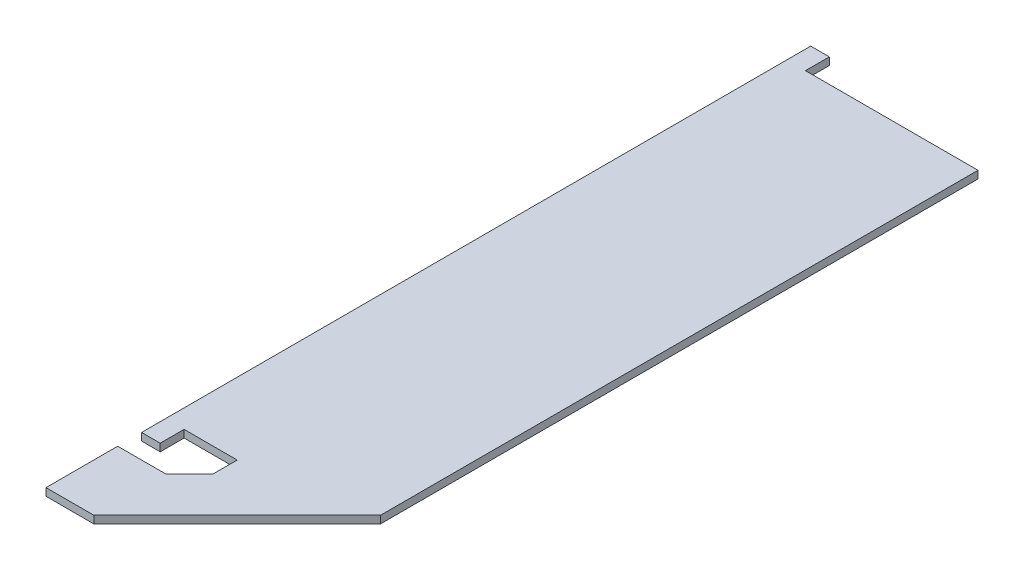
ISO-10303-21;
HEADER;
FILE_DESCRIPTION(('STEP AP214'),'2;1');
FILE_NAME('part.step','',(''),(''),'','','');
FILE_SCHEMA(('AUTOMOTIVE_DESIGN { 1 0 10303 214 1 1 1 1 }'));
ENDSEC;
DATA;
#1=APPLICATION_CONTEXT('core data for automotive mechanical design processes');
#2=APPLICATION_PROTOCOL_DEFINITION('international standard','automotive_design',2000,#1);
#3=PRODUCT_CONTEXT('',#1,'mechanical');
#4=PRODUCT('Part','Part','',(#3));
#5=PRODUCT_RELATED_PRODUCT_CATEGORY('part','',(#4));
#6=PRODUCT_DEFINITION_FORMATION('','',#4);
#7=PRODUCT_DEFINITION_CONTEXT('part definition',#1,'design');
#8=PRODUCT_DEFINITION('design','',#6,#7);
#9=PRODUCT_DEFINITION_SHAPE('','',#8);
#10=(LENGTH_UNIT() NAMED_UNIT(*) SI_UNIT(.MILLI.,.METRE.));
#11=(NAMED_UNIT(*) PLANE_ANGLE_UNIT() SI_UNIT($,.RADIAN.));
#12=(NAMED_UNIT(*) SI_UNIT($,.STERADIAN.) SOLID_ANGLE_UNIT());
#13=UNCERTAINTY_MEASURE_WITH_UNIT(LENGTH_MEASURE(1.E-05),#10,'distance_accuracy_value','');
#14=(GEOMETRIC_REPRESENTATION_CONTEXT(3) GLOBAL_UNCERTAINTY_ASSIGNED_CONTEXT((#13)) GLOBAL_UNIT_ASSIGNED_CONTEXT((#10,
#11,#12)) REPRESENTATION_CONTEXT('',''));
#15=CARTESIAN_POINT('',(0.,0.,0.));
#16=DIRECTION('',(0.,0.,1.));
#17=DIRECTION('',(1.,0.,0.));
#18=AXIS2_PLACEMENT_3D('',#15,#16,#17);
#19=CARTESIAN_POINT('',(-12.7,1.00076,41.275));
#20=DIRECTION('',(0.,0.,-1.));
#21=DIRECTION('',(-1.,0.,0.));
#22=AXIS2_PLACEMENT_3D('',#19,#20,#21);
#23=PLANE('',#22);
#24=DIRECTION('',(0.,1.,0.));
#25=VECTOR('',#24,1.);
#26=CARTESIAN_POINT('',(-10.2278817944119,0.,41.275));
#27=LINE('',#26,#25);
#28=CARTESIAN_POINT('',(-10.2278817944119,0.,41.275));
#29=VERTEX_POINT('',#28);
#30=CARTESIAN_POINT('',(-10.2278817944119,1.00076,41.275));
#31=VERTEX_POINT('',#30);
#32=EDGE_CURVE('E239',#29,#31,#27,.T.);
#33=ORIENTED_EDGE('',*,*,#32,.F.);
#34=DIRECTION('',(1.,0.,0.));
#35=VECTOR('',#34,1.);
#36=CARTESIAN_POINT('',(-12.7,0.,41.275));
#37=LINE('',#36,#35);
#38=CARTESIAN_POINT('',(-3.175,0.,41.275));
#39=VERTEX_POINT('',#38);
#40=EDGE_CURVE('E269',#29,#39,#37,.T.);
#41=ORIENTED_EDGE('',*,*,#40,.T.);
#42=DIRECTION('',(0.,-1.,0.));
#43=VECTOR('',#42,1.);
#44=CARTESIAN_POINT('',(-3.175,1.00076,41.275));
#45=LINE('',#44,#43);
#46=CARTESIAN_POINT('',(-3.175,1.00076,41.275));
#47=VERTEX_POINT('',#46);
#48=EDGE_CURVE('E297',#47,#39,#45,.T.);
#49=ORIENTED_EDGE('',*,*,#48,.F.);
#50=DIRECTION('',(1.,0.,0.));
#51=VECTOR('',#50,1.);
#52=CARTESIAN_POINT('',(-12.7,1.00076,41.275));
#53=LINE('',#52,#51);
#54=EDGE_CURVE('E162',#31,#47,#53,.T.);
#55=ORIENTED_EDGE('',*,*,#54,.F.);
#56=EDGE_LOOP('',(#33,#41,#49,#55));
#57=FACE_BOUND('',#56,.T.);
#58=ADVANCED_FACE('F47',(#57),#23,.F.);
#59=CARTESIAN_POINT('',(-12.7,1.00076,-41.275));
#60=DIRECTION('',(0.,0.,1.));
#61=DIRECTION('',(1.,0.,0.));
#62=AXIS2_PLACEMENT_3D('',#59,#60,#61);
#63=PLANE('',#62);
#64=DIRECTION('',(-1.,0.,0.));
#65=VECTOR('',#64,1.);
#66=CARTESIAN_POINT('',(-12.7,0.,-41.275));
#67=LINE('',#66,#65);
#68=CARTESIAN_POINT('',(12.7,0.,-41.275));
#69=VERTEX_POINT('',#68);
#70=CARTESIAN_POINT('',(-10.2278817944119,0.,-41.275));
#71=VERTEX_POINT('',#70);
#72=EDGE_CURVE('E221',#69,#71,#67,.T.);
#73=ORIENTED_EDGE('',*,*,#72,.T.);
#74=DIRECTION('',(0.,1.,0.));
#75=VECTOR('',#74,1.);
#76=CARTESIAN_POINT('',(-10.2278817944119,0.,-41.275));
#77=LINE('',#76,#75);
#78=CARTESIAN_POINT('',(-10.2278817944119,1.00076,-41.275));
#79=VERTEX_POINT('',#78);
#80=EDGE_CURVE('E174',#71,#79,#77,.T.);
#81=ORIENTED_EDGE('',*,*,#80,.T.);
#82=DIRECTION('',(-1.,0.,0.));
#83=VECTOR('',#82,1.);
#84=CARTESIAN_POINT('',(-12.7,1.00076,-41.275));
#85=LINE('',#84,#83);
#86=CARTESIAN_POINT('',(12.7,1.00076,-41.275));
#87=VERTEX_POINT('',#86);
#88=EDGE_CURVE('E163',#87,#79,#85,.T.);
#89=ORIENTED_EDGE('',*,*,#88,.F.);
#90=DIRECTION('',(0.,-1.,0.));
#91=VECTOR('',#90,1.);
#92=CARTESIAN_POINT('',(12.7,1.00076,-41.275));
#93=LINE('',#92,#91);
#94=EDGE_CURVE('E301',#87,#69,#93,.T.);
#95=ORIENTED_EDGE('',*,*,#94,.T.);
#96=EDGE_LOOP('',(#73,#81,#89,#95));
#97=FACE_BOUND('',#96,.T.);
#98=ADVANCED_FACE('F330',(#97),#63,.F.);
#99=CARTESIAN_POINT('',(-12.7,1.00076,41.275));
#100=DIRECTION('',(1.,0.,0.));
#101=DIRECTION('',(0.,0.,-1.));
#102=AXIS2_PLACEMENT_3D('',#99,#100,#101);
#103=PLANE('',#102);
#104=DIRECTION('',(0.,0.,1.));
#105=VECTOR('',#104,1.);
#106=CARTESIAN_POINT('',(-12.7,0.,41.275));
#107=LINE('',#106,#105);
#108=CARTESIAN_POINT('',(-12.7,0.,-44.45));
#109=VERTEX_POINT('',#108);
#110=CARTESIAN_POINT('',(-12.7,0.,44.45));
#111=VERTEX_POINT('',#110);
#112=EDGE_CURVE('E266',#109,#111,#107,.T.);
#113=ORIENTED_EDGE('',*,*,#112,.T.);
#114=DIRECTION('',(0.,-1.,0.));
#115=VECTOR('',#114,1.);
#116=CARTESIAN_POINT('',(-12.7,0.,44.45));
#117=LINE('',#116,#115);
#118=CARTESIAN_POINT('',(-12.7,1.00076,44.45));
#119=VERTEX_POINT('',#118);
#120=EDGE_CURVE('E156',#119,#111,#117,.T.);
#121=ORIENTED_EDGE('',*,*,#120,.F.);
#122=DIRECTION('',(0.,0.,1.));
#123=VECTOR('',#122,1.);
#124=CARTESIAN_POINT('',(-12.7,1.00076,41.275));
#125=LINE('',#124,#123);
#126=CARTESIAN_POINT('',(-12.7,1.00076,-44.45));
#127=VERTEX_POINT('',#126);
#128=EDGE_CURVE('E150',#127,#119,#125,.T.);
#129=ORIENTED_EDGE('',*,*,#128,.F.);
#130=DIRECTION('',(0.,-1.,0.));
#131=VECTOR('',#130,1.);
#132=CARTESIAN_POINT('',(-12.7,0.,-44.45));
#133=LINE('',#132,#131);
#134=EDGE_CURVE('E153',#127,#109,#133,.T.);
#135=ORIENTED_EDGE('',*,*,#134,.T.);
#136=EDGE_LOOP('',(#113,#121,#129,#135));
#137=FACE_BOUND('',#136,.T.);
#138=ADVANCED_FACE('F152',(#137),#103,.F.);
#139=CARTESIAN_POINT('',(-3.175,1.00076,41.275));
#140=DIRECTION('',(1.,0.,0.));
#141=DIRECTION('',(0.,0.,-1.));
#142=AXIS2_PLACEMENT_3D('',#139,#140,#141);
#143=PLANE('',#142);
#144=DIRECTION('',(0.,0.,1.));
#145=VECTOR('',#144,1.);
#146=CARTESIAN_POINT('',(-3.175,0.,41.275));
#147=LINE('',#146,#145);
#148=CARTESIAN_POINT('',(-3.175,0.,44.45));
#149=VERTEX_POINT('',#148);
#150=EDGE_CURVE('E272',#39,#149,#147,.T.);
#151=ORIENTED_EDGE('',*,*,#150,.T.);
#152=DIRECTION('',(0.,1.,0.));
#153=VECTOR('',#152,1.);
#154=CARTESIAN_POINT('',(-3.175,1.00076,44.45));
#155=LINE('',#154,#153);
#156=CARTESIAN_POINT('',(-3.175,1.00076,44.45));
#157=VERTEX_POINT('',#156);
#158=EDGE_CURVE('E64',#149,#157,#155,.T.);
#159=ORIENTED_EDGE('',*,*,#158,.T.);
#160=DIRECTION('',(0.,0.,1.));
#161=VECTOR('',#160,1.);
#162=CARTESIAN_POINT('',(-3.175,1.00076,41.275));
#163=LINE('',#162,#161);
#164=EDGE_CURVE('E203',#47,#157,#163,.T.);
#165=ORIENTED_EDGE('',*,*,#164,.F.);
#166=ORIENTED_EDGE('',*,*,#48,.T.);
#167=EDGE_LOOP('',(#151,#159,#165,#166));
#168=FACE_BOUND('',#167,.T.);
#169=ADVANCED_FACE('F355',(#168),#143,.F.);
#170=CARTESIAN_POINT('',(-3.175,1.00076,47.625));
#171=DIRECTION('',(0.,0.,1.));
#172=DIRECTION('',(1.,0.,0.));
#173=AXIS2_PLACEMENT_3D('',#170,#171,#172);
#174=PLANE('',#173);
#175=DIRECTION('',(-1.,0.,0.));
#176=VECTOR('',#175,1.);
#177=CARTESIAN_POINT('',(-3.175,1.00076,47.625));
#178=LINE('',#177,#176);
#179=CARTESIAN_POINT('',(-6.35000000000004,1.00076,47.625));
#180=VERTEX_POINT('',#179);
#181=CARTESIAN_POINT('',(-12.7,1.00076,47.625));
#182=VERTEX_POINT('',#181);
#183=EDGE_CURVE('E209',#180,#182,#178,.T.);
#184=ORIENTED_EDGE('',*,*,#183,.F.);
#185=DIRECTION('',(0.,-1.,0.));
#186=VECTOR('',#185,1.);
#187=CARTESIAN_POINT('',(-6.35000000000004,0.,47.625));
#188=LINE('',#187,#186);
#189=CARTESIAN_POINT('',(-6.35000000000004,0.,47.625));
#190=VERTEX_POINT('',#189);
#191=EDGE_CURVE('E318',#180,#190,#188,.T.);
#192=ORIENTED_EDGE('',*,*,#191,.T.);
#193=DIRECTION('',(-1.,0.,0.));
#194=VECTOR('',#193,1.);
#195=CARTESIAN_POINT('',(-3.175,0.,47.625));
#196=LINE('',#195,#194);
#197=CARTESIAN_POINT('',(-12.7,0.,47.625));
#198=VERTEX_POINT('',#197);
#199=EDGE_CURVE('E278',#190,#198,#196,.T.);
#200=ORIENTED_EDGE('',*,*,#199,.T.);
#201=DIRECTION('',(0.,-1.,0.));
#202=VECTOR('',#201,1.);
#203=CARTESIAN_POINT('',(-12.7,1.00076,47.625));
#204=LINE('',#203,#202);
#205=EDGE_CURVE('E293',#182,#198,#204,.T.);
#206=ORIENTED_EDGE('',*,*,#205,.F.);
#207=EDGE_LOOP('',(#184,#192,#200,#206));
#208=FACE_BOUND('',#207,.T.);
#209=ADVANCED_FACE('F350',(#208),#174,.F.);
#210=CARTESIAN_POINT('',(-12.7,1.00076,47.625));
#211=DIRECTION('',(1.,0.,0.));
#212=DIRECTION('',(0.,0.,-1.));
#213=AXIS2_PLACEMENT_3D('',#210,#211,#212);
#214=PLANE('',#213);
#215=DIRECTION('',(0.,0.,1.));
#216=VECTOR('',#215,1.);
#217=CARTESIAN_POINT('',(-12.7,0.,47.625));
#218=LINE('',#217,#216);
#219=CARTESIAN_POINT('',(-12.7,0.,57.15));
#220=VERTEX_POINT('',#219);
#221=EDGE_CURVE('E281',#198,#220,#218,.T.);
#222=ORIENTED_EDGE('',*,*,#221,.T.);
#223=DIRECTION('',(0.,-1.,0.));
#224=VECTOR('',#223,1.);
#225=CARTESIAN_POINT('',(-12.7,1.00076,57.15));
#226=LINE('',#225,#224);
#227=CARTESIAN_POINT('',(-12.7,1.00076,57.15));
#228=VERTEX_POINT('',#227);
#229=EDGE_CURVE('E220',#228,#220,#226,.T.);
#230=ORIENTED_EDGE('',*,*,#229,.F.);
#231=DIRECTION('',(0.,0.,1.));
#232=VECTOR('',#231,1.);
#233=CARTESIAN_POINT('',(-12.7,1.00076,47.625));
#234=LINE('',#233,#232);
#235=EDGE_CURVE('E212',#182,#228,#234,.T.);
#236=ORIENTED_EDGE('',*,*,#235,.F.);
#237=ORIENTED_EDGE('',*,*,#205,.T.);
#238=EDGE_LOOP('',(#222,#230,#236,#237));
#239=FACE_BOUND('',#238,.T.);
#240=ADVANCED_FACE('F348',(#239),#214,.F.);
#241=CARTESIAN_POINT('',(-12.7,1.00076,57.15));
#242=DIRECTION('',(0.,0.,-1.));
#243=DIRECTION('',(-1.,0.,0.));
#244=AXIS2_PLACEMENT_3D('',#241,#242,#243);
#245=PLANE('',#244);
#246=DIRECTION('',(1.,0.,0.));
#247=VECTOR('',#246,1.);
#248=CARTESIAN_POINT('',(-12.7,0.,57.15));
#249=LINE('',#248,#247);
#250=CARTESIAN_POINT('',(-6.35000000000011,0.,57.15));
#251=VERTEX_POINT('',#250);
#252=EDGE_CURVE('E284',#220,#251,#249,.T.);
#253=ORIENTED_EDGE('',*,*,#252,.T.);
#254=DIRECTION('',(0.,1.,0.));
#255=VECTOR('',#254,1.);
#256=CARTESIAN_POINT('',(-6.35000000000011,1.00076,57.15));
#257=LINE('',#256,#255);
#258=CARTESIAN_POINT('',(-6.35000000000011,1.00076,57.15));
#259=VERTEX_POINT('',#258);
#260=EDGE_CURVE('E312',#251,#259,#257,.T.);
#261=ORIENTED_EDGE('',*,*,#260,.T.);
#262=DIRECTION('',(1.,0.,0.));
#263=VECTOR('',#262,1.);
#264=CARTESIAN_POINT('',(-12.7,1.00076,57.15));
#265=LINE('',#264,#263);
#266=EDGE_CURVE('E216',#228,#259,#265,.T.);
#267=ORIENTED_EDGE('',*,*,#266,.F.);
#268=ORIENTED_EDGE('',*,*,#229,.T.);
#269=EDGE_LOOP('',(#253,#261,#267,#268));
#270=FACE_BOUND('',#269,.T.);
#271=ADVANCED_FACE('F339',(#270),#245,.F.);
#272=CARTESIAN_POINT('',(12.7,1.00076,57.15));
#273=DIRECTION('',(-1.,0.,0.));
#274=DIRECTION('',(0.,0.,1.));
#275=AXIS2_PLACEMENT_3D('',#272,#273,#274);
#276=PLANE('',#275);
#277=DIRECTION('',(0.,0.,-1.));
#278=VECTOR('',#277,1.);
#279=CARTESIAN_POINT('',(12.7,1.00076,41.275));
#280=LINE('',#279,#278);
#281=CARTESIAN_POINT('',(12.7,1.00076,38.1));
#282=VERTEX_POINT('',#281);
#283=EDGE_CURVE('E225',#282,#87,#280,.T.);
#284=ORIENTED_EDGE('',*,*,#283,.F.);
#285=DIRECTION('',(0.,-1.,0.));
#286=VECTOR('',#285,1.);
#287=CARTESIAN_POINT('',(12.7,1.00076,38.1));
#288=LINE('',#287,#286);
#289=CARTESIAN_POINT('',(12.7,0.,38.1));
#290=VERTEX_POINT('',#289);
#291=EDGE_CURVE('E305',#282,#290,#288,.T.);
#292=ORIENTED_EDGE('',*,*,#291,.T.);
#293=DIRECTION('',(0.,0.,-1.));
#294=VECTOR('',#293,1.);
#295=CARTESIAN_POINT('',(12.7,0.,57.15));
#296=LINE('',#295,#294);
#297=EDGE_CURVE('E229',#290,#69,#296,.T.);
#298=ORIENTED_EDGE('',*,*,#297,.T.);
#299=ORIENTED_EDGE('',*,*,#94,.F.);
#300=EDGE_LOOP('',(#284,#292,#298,#299));
#301=FACE_BOUND('',#300,.T.);
#302=ADVANCED_FACE('F332',(#301),#276,.F.);
#303=CARTESIAN_POINT('',(0.,1.00076,0.));
#304=DIRECTION('',(0.,-1.,0.));
#305=DIRECTION('',(0.,0.,-1.));
#306=AXIS2_PLACEMENT_3D('',#303,#304,#305);
#307=PLANE('',#306);
#308=ORIENTED_EDGE('',*,*,#266,.T.);
#309=DIRECTION('',(-0.707106781186549,0.,0.707106781186546));
#310=VECTOR('',#309,1.);
#311=CARTESIAN_POINT('',(12.7,1.00076,38.1));
#312=LINE('',#311,#310);
#313=EDGE_CURVE('E315',#259,#282,#312,.F.);
#314=ORIENTED_EDGE('',*,*,#313,.T.);
#315=ORIENTED_EDGE('',*,*,#283,.T.);
#316=ORIENTED_EDGE('',*,*,#88,.T.);
#317=DIRECTION('',(0.,0.,1.));
#318=VECTOR('',#317,1.);
#319=CARTESIAN_POINT('',(-10.2278817944119,1.00076,-44.45));
#320=LINE('',#319,#318);
#321=CARTESIAN_POINT('',(-10.2278817944119,1.00076,-44.45));
#322=VERTEX_POINT('',#321);
#323=EDGE_CURVE('E179',#322,#79,#320,.T.);
#324=ORIENTED_EDGE('',*,*,#323,.F.);
#325=DIRECTION('',(-1.,0.,0.));
#326=VECTOR('',#325,1.);
#327=CARTESIAN_POINT('',(-12.7,1.00076,-44.45));
#328=LINE('',#327,#326);
#329=EDGE_CURVE('E169',#322,#127,#328,.T.);
#330=ORIENTED_EDGE('',*,*,#329,.T.);
#331=ORIENTED_EDGE('',*,*,#128,.T.);
#332=DIRECTION('',(-1.,0.,0.));
#333=VECTOR('',#332,1.);
#334=CARTESIAN_POINT('',(-12.7,1.00076,44.45));
#335=LINE('',#334,#333);
#336=CARTESIAN_POINT('',(-10.2278817944119,1.00076,44.45));
#337=VERTEX_POINT('',#336);
#338=EDGE_CURVE('E238',#337,#119,#335,.T.);
#339=ORIENTED_EDGE('',*,*,#338,.F.);
#340=DIRECTION('',(0.,0.,-1.));
#341=VECTOR('',#340,1.);
#342=CARTESIAN_POINT('',(-10.2278817944119,1.00076,44.45));
#343=LINE('',#342,#341);
#344=EDGE_CURVE('E233',#337,#31,#343,.T.);
#345=ORIENTED_EDGE('',*,*,#344,.T.);
#346=ORIENTED_EDGE('',*,*,#54,.T.);
#347=ORIENTED_EDGE('',*,*,#164,.T.);
#348=DIRECTION('',(0.707106781186552,0.,-0.707106781186543));
#349=VECTOR('',#348,1.);
#350=CARTESIAN_POINT('',(20.6375,1.00076,20.6375000000003));
#351=LINE('',#350,#349);
#352=EDGE_CURVE('E12',#157,#180,#351,.F.);
#353=ORIENTED_EDGE('',*,*,#352,.T.);
#354=ORIENTED_EDGE('',*,*,#183,.T.);
#355=ORIENTED_EDGE('',*,*,#235,.T.);
#356=EDGE_LOOP('',(#308,#314,#315,#316,#324,#330,#331,#339,#345,#346,#347,#353,#354,#355));
#357=FACE_BOUND('',#356,.T.);
#358=ADVANCED_FACE('F177',(#357),#307,.F.);
#359=CARTESIAN_POINT('',(0.,0.,0.));
#360=DIRECTION('',(0.,-1.,0.));
#361=DIRECTION('',(0.,0.,-1.));
#362=AXIS2_PLACEMENT_3D('',#359,#360,#361);
#363=PLANE('',#362);
#364=ORIENTED_EDGE('',*,*,#297,.F.);
#365=DIRECTION('',(0.707106781186549,0.,-0.707106781186546));
#366=VECTOR('',#365,1.);
#367=CARTESIAN_POINT('',(25.4,0.,25.4000000000001));
#368=LINE('',#367,#366);
#369=EDGE_CURVE('E309',#290,#251,#368,.F.);
#370=ORIENTED_EDGE('',*,*,#369,.T.);
#371=ORIENTED_EDGE('',*,*,#252,.F.);
#372=ORIENTED_EDGE('',*,*,#221,.F.);
#373=ORIENTED_EDGE('',*,*,#199,.F.);
#374=DIRECTION('',(-0.707106781186552,0.,0.707106781186543));
#375=VECTOR('',#374,1.);
#376=CARTESIAN_POINT('',(-6.35000000000004,0.,47.625));
#377=LINE('',#376,#375);
#378=EDGE_CURVE('E57',#190,#149,#377,.F.);
#379=ORIENTED_EDGE('',*,*,#378,.T.);
#380=ORIENTED_EDGE('',*,*,#150,.F.);
#381=ORIENTED_EDGE('',*,*,#40,.F.);
#382=DIRECTION('',(0.,0.,-1.));
#383=VECTOR('',#382,1.);
#384=CARTESIAN_POINT('',(-10.2278817944119,0.,44.45));
#385=LINE('',#384,#383);
#386=CARTESIAN_POINT('',(-10.2278817944119,0.,44.45));
#387=VERTEX_POINT('',#386);
#388=EDGE_CURVE('E230',#387,#29,#385,.T.);
#389=ORIENTED_EDGE('',*,*,#388,.F.);
#390=DIRECTION('',(1.,0.,0.));
#391=VECTOR('',#390,1.);
#392=CARTESIAN_POINT('',(-12.7,0.,44.45));
#393=LINE('',#392,#391);
#394=EDGE_CURVE('E248',#111,#387,#393,.T.);
#395=ORIENTED_EDGE('',*,*,#394,.F.);
#396=ORIENTED_EDGE('',*,*,#112,.F.);
#397=DIRECTION('',(1.,0.,0.));
#398=VECTOR('',#397,1.);
#399=CARTESIAN_POINT('',(-12.7,0.,-44.45));
#400=LINE('',#399,#398);
#401=CARTESIAN_POINT('',(-10.2278817944119,0.,-44.45));
#402=VERTEX_POINT('',#401);
#403=EDGE_CURVE('E172',#109,#402,#400,.T.);
#404=ORIENTED_EDGE('',*,*,#403,.T.);
#405=DIRECTION('',(0.,0.,1.));
#406=VECTOR('',#405,1.);
#407=CARTESIAN_POINT('',(-10.2278817944119,0.,-44.45));
#408=LINE('',#407,#406);
#409=EDGE_CURVE('E255',#402,#71,#408,.T.);
#410=ORIENTED_EDGE('',*,*,#409,.T.);
#411=ORIENTED_EDGE('',*,*,#72,.F.);
#412=EDGE_LOOP('',(#364,#370,#371,#372,#373,#379,#380,#381,#389,#395,#396,#404,#410,#411));
#413=FACE_BOUND('',#412,.T.);
#414=ADVANCED_FACE('F262',(#413),#363,.T.);
#415=CARTESIAN_POINT('',(-10.2278817944119,0.,44.45));
#416=DIRECTION('',(-1.,0.,0.));
#417=DIRECTION('',(0.,0.,1.));
#418=AXIS2_PLACEMENT_3D('',#415,#416,#417);
#419=PLANE('',#418);
#420=ORIENTED_EDGE('',*,*,#32,.T.);
#421=ORIENTED_EDGE('',*,*,#344,.F.);
#422=DIRECTION('',(0.,1.,0.));
#423=VECTOR('',#422,1.);
#424=CARTESIAN_POINT('',(-10.2278817944119,0.,44.45));
#425=LINE('',#424,#423);
#426=EDGE_CURVE('E245',#387,#337,#425,.T.);
#427=ORIENTED_EDGE('',*,*,#426,.F.);
#428=ORIENTED_EDGE('',*,*,#388,.T.);
#429=EDGE_LOOP('',(#420,#421,#427,#428));
#430=FACE_BOUND('',#429,.T.);
#431=ADVANCED_FACE('F361',(#430),#419,.F.);
#432=CARTESIAN_POINT('',(0.,0.,44.45));
#433=DIRECTION('',(0.,0.,-1.));
#434=DIRECTION('',(-1.,0.,0.));
#435=AXIS2_PLACEMENT_3D('',#432,#433,#434);
#436=PLANE('',#435);
#437=ORIENTED_EDGE('',*,*,#120,.T.);
#438=ORIENTED_EDGE('',*,*,#394,.T.);
#439=ORIENTED_EDGE('',*,*,#426,.T.);
#440=ORIENTED_EDGE('',*,*,#338,.T.);
#441=EDGE_LOOP('',(#437,#438,#439,#440));
#442=FACE_BOUND('',#441,.T.);
#443=ADVANCED_FACE('F363',(#442),#436,.F.);
#444=CARTESIAN_POINT('',(-10.2278817944119,0.,-44.45));
#445=DIRECTION('',(1.,0.,0.));
#446=DIRECTION('',(0.,0.,-1.));
#447=AXIS2_PLACEMENT_3D('',#444,#445,#446);
#448=PLANE('',#447);
#449=ORIENTED_EDGE('',*,*,#80,.F.);
#450=ORIENTED_EDGE('',*,*,#409,.F.);
#451=DIRECTION('',(0.,1.,0.));
#452=VECTOR('',#451,1.);
#453=CARTESIAN_POINT('',(-10.2278817944119,0.,-44.45));
#454=LINE('',#453,#452);
#455=EDGE_CURVE('E181',#402,#322,#454,.T.);
#456=ORIENTED_EDGE('',*,*,#455,.T.);
#457=ORIENTED_EDGE('',*,*,#323,.T.);
#458=EDGE_LOOP('',(#449,#450,#456,#457));
#459=FACE_BOUND('',#458,.T.);
#460=ADVANCED_FACE('F365',(#459),#448,.T.);
#461=CARTESIAN_POINT('',(0.,0.,-44.45));
#462=DIRECTION('',(0.,0.,1.));
#463=DIRECTION('',(-1.,0.,0.));
#464=AXIS2_PLACEMENT_3D('',#461,#462,#463);
#465=PLANE('',#464);
#466=ORIENTED_EDGE('',*,*,#134,.F.);
#467=ORIENTED_EDGE('',*,*,#329,.F.);
#468=ORIENTED_EDGE('',*,*,#455,.F.);
#469=ORIENTED_EDGE('',*,*,#403,.F.);
#470=EDGE_LOOP('',(#466,#467,#468,#469));
#471=FACE_BOUND('',#470,.T.);
#472=ADVANCED_FACE('F167',(#471),#465,.F.);
#473=CARTESIAN_POINT('',(12.7,1.00076,38.1));
#474=DIRECTION('',(-0.707106781186546,0.,-0.707106781186549));
#475=DIRECTION('',(0.,-1.,0.));
#476=AXIS2_PLACEMENT_3D('',#473,#474,#475);
#477=PLANE('',#476);
#478=ORIENTED_EDGE('',*,*,#313,.F.);
#479=ORIENTED_EDGE('',*,*,#260,.F.);
#480=ORIENTED_EDGE('',*,*,#369,.F.);
#481=ORIENTED_EDGE('',*,*,#291,.F.);
#482=EDGE_LOOP('',(#478,#479,#480,#481));
#483=FACE_BOUND('',#482,.T.);
#484=ADVANCED_FACE('F343',(#483),#477,.F.);
#485=CARTESIAN_POINT('',(-6.35000000000004,1.00076,47.625));
#486=DIRECTION('',(-0.707106781186543,0.,-0.707106781186552));
#487=DIRECTION('',(0.,1.,0.));
#488=AXIS2_PLACEMENT_3D('',#485,#486,#487);
#489=PLANE('',#488);
#490=ORIENTED_EDGE('',*,*,#352,.F.);
#491=ORIENTED_EDGE('',*,*,#158,.F.);
#492=ORIENTED_EDGE('',*,*,#378,.F.);
#493=ORIENTED_EDGE('',*,*,#191,.F.);
#494=EDGE_LOOP('',(#490,#491,#492,#493));
#495=FACE_BOUND('',#494,.T.);
#496=ADVANCED_FACE('F50',(#495),#489,.T.);
#497=CLOSED_SHELL('',(#58,#98,#138,#169,#209,#240,#271,#302,#358,#414,#431,#443,#460,#472,#484,#496));
#498=MANIFOLD_SOLID_BREP('B2',#497);
#499=ADVANCED_BREP_SHAPE_REPRESENTATION('',(#18,#498),#14);
#500=SHAPE_DEFINITION_REPRESENTATION(#9,#499);
ENDSEC;
END-ISO-10303-21;
